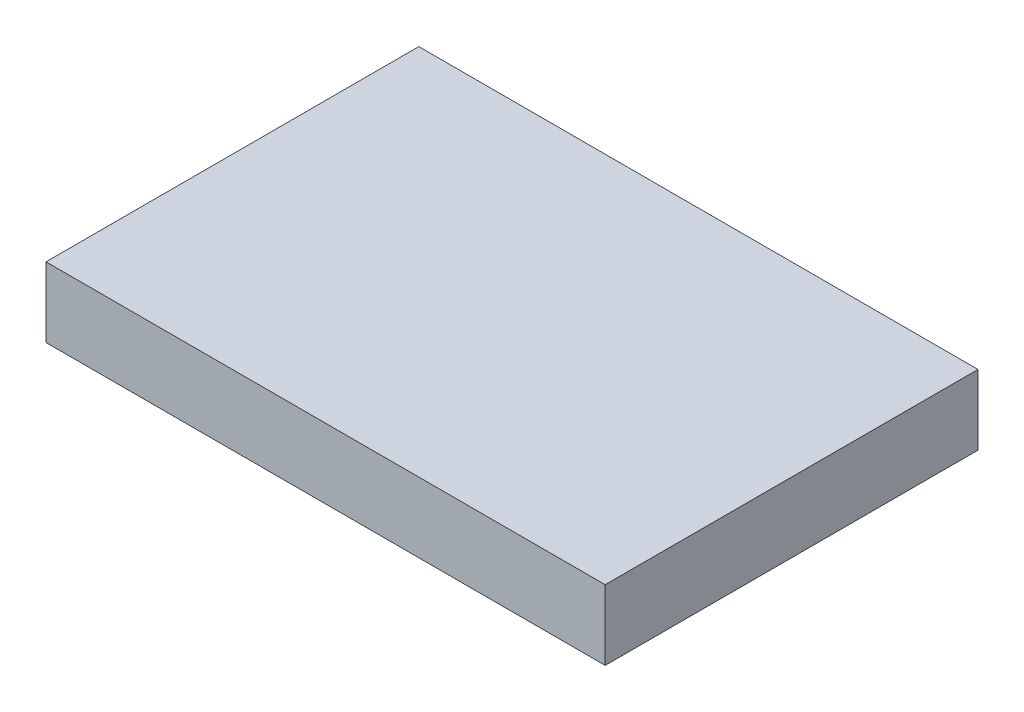
ISO-10303-21;
HEADER;
FILE_DESCRIPTION(('STEP AP214'),'2;1');
FILE_NAME('part.step','',(''),(''),'','','');
FILE_SCHEMA(('AUTOMOTIVE_DESIGN { 1 0 10303 214 1 1 1 1 }'));
ENDSEC;
DATA;
#1=APPLICATION_CONTEXT('core data for automotive mechanical design processes');
#2=APPLICATION_PROTOCOL_DEFINITION('international standard','automotive_design',2000,#1);
#3=PRODUCT_CONTEXT('',#1,'mechanical');
#4=PRODUCT('Part','Part','',(#3));
#5=PRODUCT_RELATED_PRODUCT_CATEGORY('part','',(#4));
#6=PRODUCT_DEFINITION_FORMATION('','',#4);
#7=PRODUCT_DEFINITION_CONTEXT('part definition',#1,'design');
#8=PRODUCT_DEFINITION('design','',#6,#7);
#9=PRODUCT_DEFINITION_SHAPE('','',#8);
#10=(LENGTH_UNIT() NAMED_UNIT(*) SI_UNIT(.MILLI.,.METRE.));
#11=(NAMED_UNIT(*) PLANE_ANGLE_UNIT() SI_UNIT($,.RADIAN.));
#12=(NAMED_UNIT(*) SI_UNIT($,.STERADIAN.) SOLID_ANGLE_UNIT());
#13=UNCERTAINTY_MEASURE_WITH_UNIT(LENGTH_MEASURE(1.E-05),#10,'distance_accuracy_value','');
#14=(GEOMETRIC_REPRESENTATION_CONTEXT(3) GLOBAL_UNCERTAINTY_ASSIGNED_CONTEXT((#13)) GLOBAL_UNIT_ASSIGNED_CONTEXT((#10,
#11,#12)) REPRESENTATION_CONTEXT('',''));
#15=CARTESIAN_POINT('',(0.,0.,0.));
#16=DIRECTION('',(0.,0.,1.));
#17=DIRECTION('',(1.,0.,0.));
#18=AXIS2_PLACEMENT_3D('',#15,#16,#17);
#19=CARTESIAN_POINT('',(0.,3.,0.));
#20=DIRECTION('',(1.,0.,0.));
#21=DIRECTION('',(0.,0.,-1.));
#22=AXIS2_PLACEMENT_3D('',#19,#20,#21);
#23=PLANE('',#22);
#24=DIRECTION('',(0.,0.,1.));
#25=VECTOR('',#24,1.);
#26=CARTESIAN_POINT('',(0.,0.,0.));
#27=LINE('',#26,#25);
#28=CARTESIAN_POINT('',(0.,0.,-16.));
#29=VERTEX_POINT('',#28);
#30=CARTESIAN_POINT('',(0.,0.,0.));
#31=VERTEX_POINT('',#30);
#32=EDGE_CURVE('E100',#29,#31,#27,.T.);
#33=ORIENTED_EDGE('',*,*,#32,.T.);
#34=DIRECTION('',(0.,-1.,0.));
#35=VECTOR('',#34,1.);
#36=CARTESIAN_POINT('',(0.,3.,0.));
#37=LINE('',#36,#35);
#38=CARTESIAN_POINT('',(0.,3.,0.));
#39=VERTEX_POINT('',#38);
#40=EDGE_CURVE('E11',#39,#31,#37,.T.);
#41=ORIENTED_EDGE('',*,*,#40,.F.);
#42=DIRECTION('',(0.,0.,1.));
#43=VECTOR('',#42,1.);
#44=CARTESIAN_POINT('',(0.,3.,0.));
#45=LINE('',#44,#43);
#46=CARTESIAN_POINT('',(0.,3.,-16.));
#47=VERTEX_POINT('',#46);
#48=EDGE_CURVE('E88',#47,#39,#45,.T.);
#49=ORIENTED_EDGE('',*,*,#48,.F.);
#50=DIRECTION('',(0.,-1.,0.));
#51=VECTOR('',#50,1.);
#52=CARTESIAN_POINT('',(0.,3.,-16.));
#53=LINE('',#52,#51);
#54=EDGE_CURVE('E96',#47,#29,#53,.T.);
#55=ORIENTED_EDGE('',*,*,#54,.T.);
#56=EDGE_LOOP('',(#33,#41,#49,#55));
#57=FACE_BOUND('',#56,.T.);
#58=ADVANCED_FACE('F37',(#57),#23,.F.);
#59=CARTESIAN_POINT('',(0.,3.,0.));
#60=DIRECTION('',(0.,0.,-1.));
#61=DIRECTION('',(-1.,0.,0.));
#62=AXIS2_PLACEMENT_3D('',#59,#60,#61);
#63=PLANE('',#62);
#64=DIRECTION('',(1.,0.,0.));
#65=VECTOR('',#64,1.);
#66=CARTESIAN_POINT('',(0.,0.,0.));
#67=LINE('',#66,#65);
#68=CARTESIAN_POINT('',(24.,0.,0.));
#69=VERTEX_POINT('',#68);
#70=EDGE_CURVE('E92',#31,#69,#67,.T.);
#71=ORIENTED_EDGE('',*,*,#70,.T.);
#72=DIRECTION('',(0.,-1.,0.));
#73=VECTOR('',#72,1.);
#74=CARTESIAN_POINT('',(24.,3.,0.));
#75=LINE('',#74,#73);
#76=CARTESIAN_POINT('',(24.,3.,0.));
#77=VERTEX_POINT('',#76);
#78=EDGE_CURVE('E45',#77,#69,#75,.T.);
#79=ORIENTED_EDGE('',*,*,#78,.F.);
#80=DIRECTION('',(1.,0.,0.));
#81=VECTOR('',#80,1.);
#82=CARTESIAN_POINT('',(0.,3.,0.));
#83=LINE('',#82,#81);
#84=EDGE_CURVE('E83',#39,#77,#83,.T.);
#85=ORIENTED_EDGE('',*,*,#84,.F.);
#86=ORIENTED_EDGE('',*,*,#40,.T.);
#87=EDGE_LOOP('',(#71,#79,#85,#86));
#88=FACE_BOUND('',#87,.T.);
#89=ADVANCED_FACE('F91',(#88),#63,.F.);
#90=CARTESIAN_POINT('',(24.,3.,0.));
#91=DIRECTION('',(-1.,0.,0.));
#92=DIRECTION('',(0.,0.,1.));
#93=AXIS2_PLACEMENT_3D('',#90,#91,#92);
#94=PLANE('',#93);
#95=DIRECTION('',(0.,0.,-1.));
#96=VECTOR('',#95,1.);
#97=CARTESIAN_POINT('',(24.,0.,0.));
#98=LINE('',#97,#96);
#99=CARTESIAN_POINT('',(24.,0.,-16.));
#100=VERTEX_POINT('',#99);
#101=EDGE_CURVE('E70',#69,#100,#98,.T.);
#102=ORIENTED_EDGE('',*,*,#101,.T.);
#103=DIRECTION('',(0.,-1.,0.));
#104=VECTOR('',#103,1.);
#105=CARTESIAN_POINT('',(24.,3.,-16.));
#106=LINE('',#105,#104);
#107=CARTESIAN_POINT('',(24.,3.,-16.));
#108=VERTEX_POINT('',#107);
#109=EDGE_CURVE('E93',#108,#100,#106,.T.);
#110=ORIENTED_EDGE('',*,*,#109,.F.);
#111=DIRECTION('',(0.,0.,-1.));
#112=VECTOR('',#111,1.);
#113=CARTESIAN_POINT('',(24.,3.,0.));
#114=LINE('',#113,#112);
#115=EDGE_CURVE('E86',#77,#108,#114,.T.);
#116=ORIENTED_EDGE('',*,*,#115,.F.);
#117=ORIENTED_EDGE('',*,*,#78,.T.);
#118=EDGE_LOOP('',(#102,#110,#116,#117));
#119=FACE_BOUND('',#118,.T.);
#120=ADVANCED_FACE('F94',(#119),#94,.F.);
#121=CARTESIAN_POINT('',(0.,3.,-16.));
#122=DIRECTION('',(0.,0.,1.));
#123=DIRECTION('',(1.,0.,0.));
#124=AXIS2_PLACEMENT_3D('',#121,#122,#123);
#125=PLANE('',#124);
#126=DIRECTION('',(-1.,0.,0.));
#127=VECTOR('',#126,1.);
#128=CARTESIAN_POINT('',(0.,0.,-16.));
#129=LINE('',#128,#127);
#130=EDGE_CURVE('E76',#100,#29,#129,.T.);
#131=ORIENTED_EDGE('',*,*,#130,.T.);
#132=ORIENTED_EDGE('',*,*,#54,.F.);
#133=DIRECTION('',(-1.,0.,0.));
#134=VECTOR('',#133,1.);
#135=CARTESIAN_POINT('',(0.,3.,-16.));
#136=LINE('',#135,#134);
#137=EDGE_CURVE('E53',#108,#47,#136,.T.);
#138=ORIENTED_EDGE('',*,*,#137,.F.);
#139=ORIENTED_EDGE('',*,*,#109,.T.);
#140=EDGE_LOOP('',(#131,#132,#138,#139));
#141=FACE_BOUND('',#140,.T.);
#142=ADVANCED_FACE('F107',(#141),#125,.F.);
#143=CARTESIAN_POINT('',(0.,3.,0.));
#144=DIRECTION('',(0.,-1.,0.));
#145=DIRECTION('',(0.,0.,-1.));
#146=AXIS2_PLACEMENT_3D('',#143,#144,#145);
#147=PLANE('',#146);
#148=ORIENTED_EDGE('',*,*,#48,.T.);
#149=ORIENTED_EDGE('',*,*,#84,.T.);
#150=ORIENTED_EDGE('',*,*,#115,.T.);
#151=ORIENTED_EDGE('',*,*,#137,.T.);
#152=EDGE_LOOP('',(#148,#149,#150,#151));
#153=FACE_BOUND('',#152,.T.);
#154=ADVANCED_FACE('F84',(#153),#147,.F.);
#155=CARTESIAN_POINT('',(0.,0.,0.));
#156=DIRECTION('',(0.,-1.,0.));
#157=DIRECTION('',(0.,0.,-1.));
#158=AXIS2_PLACEMENT_3D('',#155,#156,#157);
#159=PLANE('',#158);
#160=ORIENTED_EDGE('',*,*,#32,.F.);
#161=ORIENTED_EDGE('',*,*,#130,.F.);
#162=ORIENTED_EDGE('',*,*,#101,.F.);
#163=ORIENTED_EDGE('',*,*,#70,.F.);
#164=EDGE_LOOP('',(#160,#161,#162,#163));
#165=FACE_BOUND('',#164,.T.);
#166=ADVANCED_FACE('F110',(#165),#159,.T.);
#167=CLOSED_SHELL('',(#58,#89,#120,#142,#154,#166));
#168=MANIFOLD_SOLID_BREP('B2',#167);
#169=ADVANCED_BREP_SHAPE_REPRESENTATION('',(#18,#168),#14);
#170=SHAPE_DEFINITION_REPRESENTATION(#9,#169);
ENDSEC;
END-ISO-10303-21;
